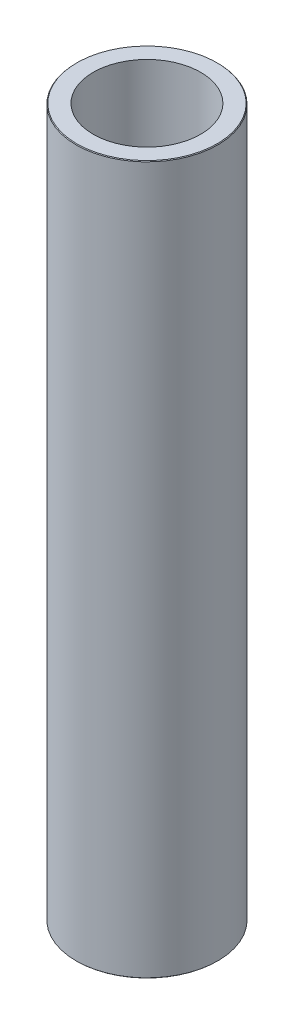
ISO-10303-21;
HEADER;
FILE_DESCRIPTION(('STEP AP214'),'2;1');
FILE_NAME('part.step','',(''),(''),'','','');
FILE_SCHEMA(('AUTOMOTIVE_DESIGN { 1 0 10303 214 1 1 1 1 }'));
ENDSEC;
DATA;
#1=APPLICATION_CONTEXT('core data for automotive mechanical design processes');
#2=APPLICATION_PROTOCOL_DEFINITION('international standard','automotive_design',2000,#1);
#3=PRODUCT_CONTEXT('',#1,'mechanical');
#4=PRODUCT('Part','Part','',(#3));
#5=PRODUCT_RELATED_PRODUCT_CATEGORY('part','',(#4));
#6=PRODUCT_DEFINITION_FORMATION('','',#4);
#7=PRODUCT_DEFINITION_CONTEXT('part definition',#1,'design');
#8=PRODUCT_DEFINITION('design','',#6,#7);
#9=PRODUCT_DEFINITION_SHAPE('','',#8);
#10=(LENGTH_UNIT() NAMED_UNIT(*) SI_UNIT(.MILLI.,.METRE.));
#11=(NAMED_UNIT(*) PLANE_ANGLE_UNIT() SI_UNIT($,.RADIAN.));
#12=(NAMED_UNIT(*) SI_UNIT($,.STERADIAN.) SOLID_ANGLE_UNIT());
#13=UNCERTAINTY_MEASURE_WITH_UNIT(LENGTH_MEASURE(1.E-05),#10,'distance_accuracy_value','');
#14=(GEOMETRIC_REPRESENTATION_CONTEXT(3) GLOBAL_UNCERTAINTY_ASSIGNED_CONTEXT((#13)) GLOBAL_UNIT_ASSIGNED_CONTEXT((#10,
#11,#12)) REPRESENTATION_CONTEXT('',''));
#15=CARTESIAN_POINT('',(0.,0.,0.));
#16=DIRECTION('',(0.,0.,1.));
#17=DIRECTION('',(1.,0.,0.));
#18=AXIS2_PLACEMENT_3D('',#15,#16,#17);
#19=CARTESIAN_POINT('',(0.,600.,0.));
#20=DIRECTION('',(0.,-1.,0.));
#21=DIRECTION('',(0.,0.,-1.));
#22=AXIS2_PLACEMENT_3D('',#19,#20,#21);
#23=CYLINDRICAL_SURFACE('',#22,60.);
#24=CARTESIAN_POINT('',(0.,599.419359970894,0.));
#25=DIRECTION('',(0.,1.,0.));
#26=DIRECTION('',(0.,0.,1.));
#27=AXIS2_PLACEMENT_3D('',#24,#25,#26);
#28=CIRCLE('',#27,60.);
#29=CARTESIAN_POINT('',(0.,599.419359970894,60.));
#30=VERTEX_POINT('',#29);
#31=EDGE_CURVE('E50',#30,#30,#28,.F.);
#32=ORIENTED_EDGE('',*,*,#31,.T.);
#33=EDGE_LOOP('',(#32));
#34=FACE_BOUND('',#33,.T.);
#35=CARTESIAN_POINT('',(0.,0.539445161178431,0.));
#36=DIRECTION('',(0.,1.,0.));
#37=DIRECTION('',(0.,0.,1.));
#38=AXIS2_PLACEMENT_3D('',#35,#36,#37);
#39=CIRCLE('',#38,60.);
#40=CARTESIAN_POINT('',(0.,0.539445161178431,60.));
#41=VERTEX_POINT('',#40);
#42=EDGE_CURVE('E51',#41,#41,#39,.T.);
#43=ORIENTED_EDGE('',*,*,#42,.T.);
#44=EDGE_LOOP('',(#43));
#45=FACE_BOUND('',#44,.T.);
#46=ADVANCED_FACE('F39',(#34,#45),#23,.T.);
#47=CARTESIAN_POINT('',(0.,600.,0.));
#48=DIRECTION('',(0.,1.,0.));
#49=DIRECTION('',(0.,0.,1.));
#50=AXIS2_PLACEMENT_3D('',#47,#48,#49);
#51=PLANE('',#50);
#52=CARTESIAN_POINT('',(0.,600.,0.));
#53=DIRECTION('',(0.,1.,0.));
#54=DIRECTION('',(0.,0.,1.));
#55=AXIS2_PLACEMENT_3D('',#52,#53,#54);
#56=CIRCLE('',#55,59.4605548388214);
#57=CARTESIAN_POINT('',(0.,600.,59.4605548388214));
#58=VERTEX_POINT('',#57);
#59=EDGE_CURVE('E54',#58,#58,#56,.T.);
#60=ORIENTED_EDGE('',*,*,#59,.T.);
#61=EDGE_LOOP('',(#60));
#62=FACE_BOUND('',#61,.T.);
#63=CARTESIAN_POINT('',(0.,600.,0.));
#64=DIRECTION('',(0.,1.,0.));
#65=DIRECTION('',(0.,0.,1.));
#66=AXIS2_PLACEMENT_3D('',#63,#64,#65);
#67=CIRCLE('',#66,45.546096506993);
#68=CARTESIAN_POINT('',(0.,600.,45.546096506993));
#69=VERTEX_POINT('',#68);
#70=EDGE_CURVE('E58',#69,#69,#67,.T.);
#71=ORIENTED_EDGE('',*,*,#70,.F.);
#72=EDGE_LOOP('',(#71));
#73=FACE_BOUND('',#72,.T.);
#74=ADVANCED_FACE('F69',(#62,#73),#51,.T.);
#75=CARTESIAN_POINT('',(0.,0.,0.));
#76=DIRECTION('',(0.,1.,0.));
#77=DIRECTION('',(0.,0.,1.));
#78=AXIS2_PLACEMENT_3D('',#75,#76,#77);
#79=PLANE('',#78);
#80=CARTESIAN_POINT('',(0.,0.,0.));
#81=DIRECTION('',(0.,1.,0.));
#82=DIRECTION('',(0.,0.,1.));
#83=AXIS2_PLACEMENT_3D('',#80,#81,#82);
#84=CIRCLE('',#83,59.4193599708942);
#85=CARTESIAN_POINT('',(0.,0.,59.4193599708942));
#86=VERTEX_POINT('',#85);
#87=EDGE_CURVE('E10',#86,#86,#84,.F.);
#88=ORIENTED_EDGE('',*,*,#87,.T.);
#89=EDGE_LOOP('',(#88));
#90=FACE_BOUND('',#89,.T.);
#91=CARTESIAN_POINT('',(0.,0.,0.));
#92=DIRECTION('',(0.,1.,0.));
#93=DIRECTION('',(0.,0.,1.));
#94=AXIS2_PLACEMENT_3D('',#91,#92,#93);
#95=CIRCLE('',#94,45.546096506993);
#96=CARTESIAN_POINT('',(0.,0.,45.546096506993));
#97=VERTEX_POINT('',#96);
#98=EDGE_CURVE('E63',#97,#97,#95,.T.);
#99=ORIENTED_EDGE('',*,*,#98,.T.);
#100=EDGE_LOOP('',(#99));
#101=FACE_BOUND('',#100,.T.);
#102=ADVANCED_FACE('F75',(#90,#101),#79,.F.);
#103=CARTESIAN_POINT('',(0.,600.,0.));
#104=DIRECTION('',(0.,-1.,0.));
#105=DIRECTION('',(0.,0.,-1.));
#106=AXIS2_PLACEMENT_3D('',#103,#104,#105);
#107=CYLINDRICAL_SURFACE('',#106,45.546096506993);
#108=ORIENTED_EDGE('',*,*,#70,.T.);
#109=EDGE_LOOP('',(#108));
#110=FACE_BOUND('',#109,.T.);
#111=ORIENTED_EDGE('',*,*,#98,.F.);
#112=EDGE_LOOP('',(#111));
#113=FACE_BOUND('',#112,.T.);
#114=ADVANCED_FACE('F70',(#110,#113),#107,.F.);
#115=CARTESIAN_POINT('',(0.,600.,0.));
#116=DIRECTION('',(0.,-1.,0.));
#117=DIRECTION('',(0.,0.,-1.));
#118=AXIS2_PLACEMENT_3D('',#115,#116,#117);
#119=CONICAL_SURFACE('',#118,59.4605548388214,0.748636398023266);
#120=ORIENTED_EDGE('',*,*,#31,.F.);
#121=EDGE_LOOP('',(#120));
#122=FACE_BOUND('',#121,.T.);
#123=ORIENTED_EDGE('',*,*,#59,.F.);
#124=EDGE_LOOP('',(#123));
#125=FACE_BOUND('',#124,.T.);
#126=ADVANCED_FACE('F81',(#122,#125),#119,.T.);
#127=CARTESIAN_POINT('',(0.,0.539445161178431,0.));
#128=DIRECTION('',(0.,1.,0.));
#129=DIRECTION('',(0.,0.,1.));
#130=AXIS2_PLACEMENT_3D('',#127,#128,#129);
#131=CONICAL_SURFACE('',#130,60.,0.822159928771588);
#132=ORIENTED_EDGE('',*,*,#87,.F.);
#133=EDGE_LOOP('',(#132));
#134=FACE_BOUND('',#133,.T.);
#135=ORIENTED_EDGE('',*,*,#42,.F.);
#136=EDGE_LOOP('',(#135));
#137=FACE_BOUND('',#136,.T.);
#138=ADVANCED_FACE('F45',(#134,#137),#131,.T.);
#139=CLOSED_SHELL('',(#46,#74,#102,#114,#126,#138));
#140=MANIFOLD_SOLID_BREP('B2',#139);
#141=ADVANCED_BREP_SHAPE_REPRESENTATION('',(#18,#140),#14);
#142=SHAPE_DEFINITION_REPRESENTATION(#9,#141);
ENDSEC;
END-ISO-10303-21;
